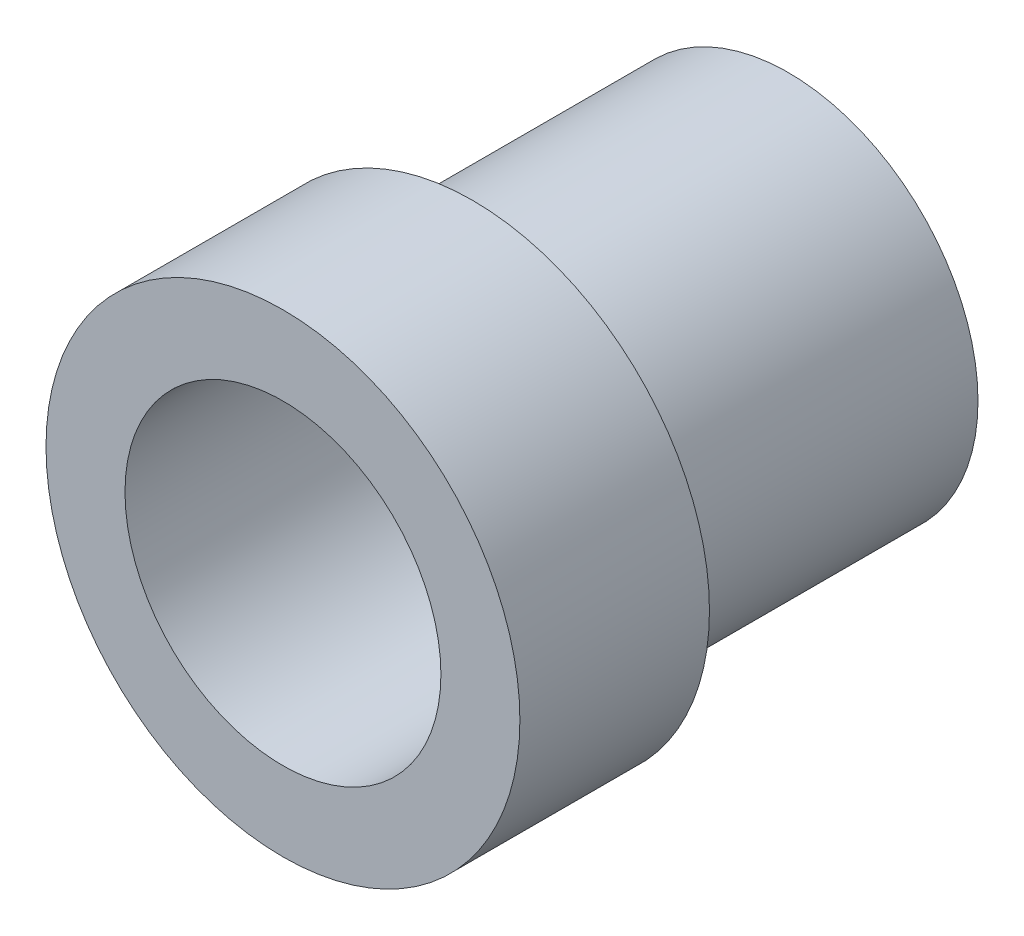
ISO-10303-21;
HEADER;
FILE_DESCRIPTION(('STEP AP214'),'2;1');
FILE_NAME('part.step','',(''),(''),'','','');
FILE_SCHEMA(('AUTOMOTIVE_DESIGN { 1 0 10303 214 1 1 1 1 }'));
ENDSEC;
DATA;
#1=APPLICATION_CONTEXT('core data for automotive mechanical design processes');
#2=APPLICATION_PROTOCOL_DEFINITION('international standard','automotive_design',2000,#1);
#3=PRODUCT_CONTEXT('',#1,'mechanical');
#4=PRODUCT('Part','Part','',(#3));
#5=PRODUCT_RELATED_PRODUCT_CATEGORY('part','',(#4));
#6=PRODUCT_DEFINITION_FORMATION('','',#4);
#7=PRODUCT_DEFINITION_CONTEXT('part definition',#1,'design');
#8=PRODUCT_DEFINITION('design','',#6,#7);
#9=PRODUCT_DEFINITION_SHAPE('','',#8);
#10=(LENGTH_UNIT() NAMED_UNIT(*) SI_UNIT(.MILLI.,.METRE.));
#11=(NAMED_UNIT(*) PLANE_ANGLE_UNIT() SI_UNIT($,.RADIAN.));
#12=(NAMED_UNIT(*) SI_UNIT($,.STERADIAN.) SOLID_ANGLE_UNIT());
#13=UNCERTAINTY_MEASURE_WITH_UNIT(LENGTH_MEASURE(1.E-05),#10,'distance_accuracy_value','');
#14=(GEOMETRIC_REPRESENTATION_CONTEXT(3) GLOBAL_UNCERTAINTY_ASSIGNED_CONTEXT((#13)) GLOBAL_UNIT_ASSIGNED_CONTEXT((#10,
#11,#12)) REPRESENTATION_CONTEXT('',''));
#15=CARTESIAN_POINT('',(0.,0.,0.));
#16=DIRECTION('',(0.,0.,1.));
#17=DIRECTION('',(1.,0.,0.));
#18=AXIS2_PLACEMENT_3D('',#15,#16,#17);
#19=CARTESIAN_POINT('',(0.,0.,10.));
#20=DIRECTION('',(0.,0.,-1.));
#21=DIRECTION('',(-1.,0.,0.));
#22=AXIS2_PLACEMENT_3D('',#19,#20,#21);
#23=CYLINDRICAL_SURFACE('',#22,6.);
#24=CARTESIAN_POINT('',(0.,0.,10.));
#25=DIRECTION('',(0.,0.,1.));
#26=DIRECTION('',(1.,0.,0.));
#27=AXIS2_PLACEMENT_3D('',#24,#25,#26);
#28=CIRCLE('',#27,6.);
#29=CARTESIAN_POINT('',(6.,0.,10.));
#30=VERTEX_POINT('',#29);
#31=EDGE_CURVE('E10',#30,#30,#28,.T.);
#32=ORIENTED_EDGE('',*,*,#31,.F.);
#33=EDGE_LOOP('',(#32));
#34=FACE_BOUND('',#33,.T.);
#35=CARTESIAN_POINT('',(0.,0.,0.));
#36=DIRECTION('',(0.,0.,1.));
#37=DIRECTION('',(1.,0.,0.));
#38=AXIS2_PLACEMENT_3D('',#35,#36,#37);
#39=CIRCLE('',#38,6.);
#40=CARTESIAN_POINT('',(6.,0.,0.));
#41=VERTEX_POINT('',#40);
#42=EDGE_CURVE('E39',#41,#41,#39,.T.);
#43=ORIENTED_EDGE('',*,*,#42,.T.);
#44=EDGE_LOOP('',(#43));
#45=FACE_BOUND('',#44,.T.);
#46=ADVANCED_FACE('F32',(#34,#45),#23,.T.);
#47=CARTESIAN_POINT('',(0.,0.,0.));
#48=DIRECTION('',(0.,0.,1.));
#49=DIRECTION('',(1.,0.,0.));
#50=AXIS2_PLACEMENT_3D('',#47,#48,#49);
#51=PLANE('',#50);
#52=CARTESIAN_POINT('',(0.,0.,0.));
#53=DIRECTION('',(0.,0.,-1.));
#54=DIRECTION('',(-1.,0.,0.));
#55=AXIS2_PLACEMENT_3D('',#52,#53,#54);
#56=CIRCLE('',#55,5.);
#57=CARTESIAN_POINT('',(-5.,0.,0.));
#58=VERTEX_POINT('',#57);
#59=EDGE_CURVE('E51',#58,#58,#56,.T.);
#60=ORIENTED_EDGE('',*,*,#59,.F.);
#61=EDGE_LOOP('',(#60));
#62=FACE_BOUND('',#61,.T.);
#63=ORIENTED_EDGE('',*,*,#42,.F.);
#64=EDGE_LOOP('',(#63));
#65=FACE_BOUND('',#64,.T.);
#66=ADVANCED_FACE('F74',(#62,#65),#51,.F.);
#67=CARTESIAN_POINT('',(0.,0.,10.));
#68=DIRECTION('',(0.,0.,1.));
#69=DIRECTION('',(1.,0.,0.));
#70=AXIS2_PLACEMENT_3D('',#67,#68,#69);
#71=PLANE('',#70);
#72=CARTESIAN_POINT('',(0.,0.,10.));
#73=DIRECTION('',(0.,0.,1.));
#74=DIRECTION('',(1.,0.,0.));
#75=AXIS2_PLACEMENT_3D('',#72,#73,#74);
#76=CIRCLE('',#75,7.5);
#77=CARTESIAN_POINT('',(7.5,0.,10.));
#78=VERTEX_POINT('',#77);
#79=EDGE_CURVE('E46',#78,#78,#76,.T.);
#80=ORIENTED_EDGE('',*,*,#79,.F.);
#81=EDGE_LOOP('',(#80));
#82=FACE_BOUND('',#81,.T.);
#83=ORIENTED_EDGE('',*,*,#31,.T.);
#84=EDGE_LOOP('',(#83));
#85=FACE_BOUND('',#84,.T.);
#86=ADVANCED_FACE('F69',(#82,#85),#71,.F.);
#87=CARTESIAN_POINT('',(0.,0.,16.));
#88=DIRECTION('',(0.,0.,-1.));
#89=DIRECTION('',(-1.,0.,0.));
#90=AXIS2_PLACEMENT_3D('',#87,#88,#89);
#91=CYLINDRICAL_SURFACE('',#90,7.5);
#92=CARTESIAN_POINT('',(0.,0.,16.));
#93=DIRECTION('',(0.,0.,1.));
#94=DIRECTION('',(1.,0.,0.));
#95=AXIS2_PLACEMENT_3D('',#92,#93,#94);
#96=CIRCLE('',#95,7.5);
#97=CARTESIAN_POINT('',(7.5,0.,16.));
#98=VERTEX_POINT('',#97);
#99=EDGE_CURVE('E44',#98,#98,#96,.T.);
#100=ORIENTED_EDGE('',*,*,#99,.F.);
#101=EDGE_LOOP('',(#100));
#102=FACE_BOUND('',#101,.T.);
#103=ORIENTED_EDGE('',*,*,#79,.T.);
#104=EDGE_LOOP('',(#103));
#105=FACE_BOUND('',#104,.T.);
#106=ADVANCED_FACE('F63',(#102,#105),#91,.T.);
#107=CARTESIAN_POINT('',(0.,0.,16.));
#108=DIRECTION('',(0.,0.,1.));
#109=DIRECTION('',(1.,0.,0.));
#110=AXIS2_PLACEMENT_3D('',#107,#108,#109);
#111=PLANE('',#110);
#112=CARTESIAN_POINT('',(0.,0.,16.));
#113=DIRECTION('',(0.,0.,1.));
#114=DIRECTION('',(1.,0.,0.));
#115=AXIS2_PLACEMENT_3D('',#112,#113,#114);
#116=CIRCLE('',#115,5.);
#117=CARTESIAN_POINT('',(5.,0.,16.));
#118=VERTEX_POINT('',#117);
#119=EDGE_CURVE('E35',#118,#118,#116,.T.);
#120=ORIENTED_EDGE('',*,*,#119,.F.);
#121=EDGE_LOOP('',(#120));
#122=FACE_BOUND('',#121,.T.);
#123=ORIENTED_EDGE('',*,*,#99,.T.);
#124=EDGE_LOOP('',(#123));
#125=FACE_BOUND('',#124,.T.);
#126=ADVANCED_FACE('F60',(#122,#125),#111,.T.);
#127=CARTESIAN_POINT('',(0.,0.,24.));
#128=DIRECTION('',(0.,0.,-1.));
#129=DIRECTION('',(-1.,0.,0.));
#130=AXIS2_PLACEMENT_3D('',#127,#128,#129);
#131=CYLINDRICAL_SURFACE('',#130,5.);
#132=ORIENTED_EDGE('',*,*,#119,.T.);
#133=EDGE_LOOP('',(#132));
#134=FACE_BOUND('',#133,.T.);
#135=ORIENTED_EDGE('',*,*,#59,.T.);
#136=EDGE_LOOP('',(#135));
#137=FACE_BOUND('',#136,.T.);
#138=ADVANCED_FACE('F58',(#134,#137),#131,.F.);
#139=CLOSED_SHELL('',(#46,#66,#86,#106,#126,#138));
#140=MANIFOLD_SOLID_BREP('B2',#139);
#141=ADVANCED_BREP_SHAPE_REPRESENTATION('',(#18,#140),#14);
#142=SHAPE_DEFINITION_REPRESENTATION(#9,#141);
ENDSEC;
END-ISO-10303-21;
